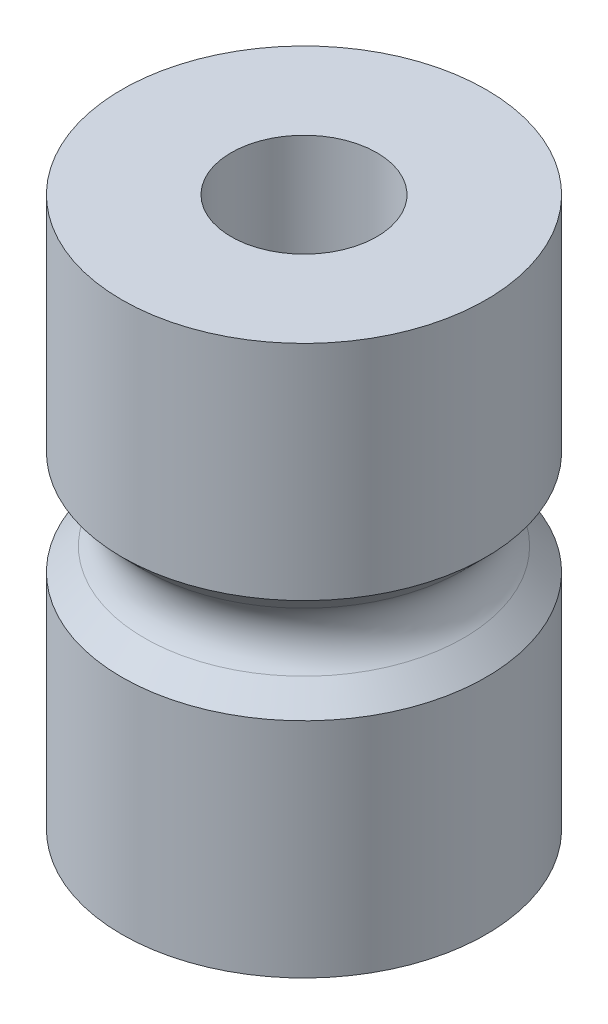
ISO-10303-21;
HEADER;
FILE_DESCRIPTION(('STEP AP214'),'2;1');
FILE_NAME('part.step','',(''),(''),'','','');
FILE_SCHEMA(('AUTOMOTIVE_DESIGN { 1 0 10303 214 1 1 1 1 }'));
ENDSEC;
DATA;
#1=APPLICATION_CONTEXT('core data for automotive mechanical design processes');
#2=APPLICATION_PROTOCOL_DEFINITION('international standard','automotive_design',2000,#1);
#3=PRODUCT_CONTEXT('',#1,'mechanical');
#4=PRODUCT('Part','Part','',(#3));
#5=PRODUCT_RELATED_PRODUCT_CATEGORY('part','',(#4));
#6=PRODUCT_DEFINITION_FORMATION('','',#4);
#7=PRODUCT_DEFINITION_CONTEXT('part definition',#1,'design');
#8=PRODUCT_DEFINITION('design','',#6,#7);
#9=PRODUCT_DEFINITION_SHAPE('','',#8);
#10=(LENGTH_UNIT() NAMED_UNIT(*) SI_UNIT(.MILLI.,.METRE.));
#11=(NAMED_UNIT(*) PLANE_ANGLE_UNIT() SI_UNIT($,.RADIAN.));
#12=(NAMED_UNIT(*) SI_UNIT($,.STERADIAN.) SOLID_ANGLE_UNIT());
#13=UNCERTAINTY_MEASURE_WITH_UNIT(LENGTH_MEASURE(1.E-05),#10,'distance_accuracy_value','');
#14=(GEOMETRIC_REPRESENTATION_CONTEXT(3) GLOBAL_UNCERTAINTY_ASSIGNED_CONTEXT((#13)) GLOBAL_UNIT_ASSIGNED_CONTEXT((#10,
#11,#12)) REPRESENTATION_CONTEXT('',''));
#15=CARTESIAN_POINT('',(0.,0.,0.));
#16=DIRECTION('',(0.,0.,1.));
#17=DIRECTION('',(1.,0.,0.));
#18=AXIS2_PLACEMENT_3D('',#15,#16,#17);
#19=CARTESIAN_POINT('',(0.,0.,0.));
#20=DIRECTION('',(0.,-1.,0.));
#21=DIRECTION('',(0.,0.,-1.));
#22=AXIS2_PLACEMENT_3D('',#19,#20,#21);
#23=CYLINDRICAL_SURFACE('',#22,4.445);
#24=CARTESIAN_POINT('',(0.,0.,0.));
#25=DIRECTION('',(0.,-1.,0.));
#26=DIRECTION('',(0.,0.,-1.));
#27=AXIS2_PLACEMENT_3D('',#24,#25,#26);
#28=CIRCLE('',#27,4.445);
#29=CARTESIAN_POINT('',(0.,0.,-4.445));
#30=VERTEX_POINT('',#29);
#31=EDGE_CURVE('E64',#30,#30,#28,.T.);
#32=ORIENTED_EDGE('',*,*,#31,.T.);
#33=EDGE_LOOP('',(#32));
#34=FACE_BOUND('',#33,.T.);
#35=CARTESIAN_POINT('',(0.,33.528,0.));
#36=DIRECTION('',(0.,-1.,0.));
#37=DIRECTION('',(0.,0.,-1.));
#38=AXIS2_PLACEMENT_3D('',#35,#36,#37);
#39=CIRCLE('',#38,4.445);
#40=CARTESIAN_POINT('',(0.,33.528,-4.445));
#41=VERTEX_POINT('',#40);
#42=EDGE_CURVE('E46',#41,#41,#39,.T.);
#43=ORIENTED_EDGE('',*,*,#42,.F.);
#44=EDGE_LOOP('',(#43));
#45=FACE_BOUND('',#44,.T.);
#46=ADVANCED_FACE('F35',(#34,#45),#23,.F.);
#47=CARTESIAN_POINT('',(4.445,33.528,0.));
#48=DIRECTION('',(0.,1.,0.));
#49=DIRECTION('',(0.,0.,1.));
#50=AXIS2_PLACEMENT_3D('',#47,#48,#49);
#51=PLANE('',#50);
#52=ORIENTED_EDGE('',*,*,#42,.T.);
#53=EDGE_LOOP('',(#52));
#54=FACE_BOUND('',#53,.T.);
#55=CARTESIAN_POINT('',(0.,33.528,0.));
#56=DIRECTION('',(0.,-1.,0.));
#57=DIRECTION('',(0.,0.,-1.));
#58=AXIS2_PLACEMENT_3D('',#55,#56,#57);
#59=CIRCLE('',#58,11.1125);
#60=CARTESIAN_POINT('',(0.,33.528,-11.1125));
#61=VERTEX_POINT('',#60);
#62=EDGE_CURVE('E50',#61,#61,#59,.T.);
#63=ORIENTED_EDGE('',*,*,#62,.F.);
#64=EDGE_LOOP('',(#63));
#65=FACE_BOUND('',#64,.T.);
#66=ADVANCED_FACE('F84',(#54,#65),#51,.T.);
#67=CARTESIAN_POINT('',(0.,0.,0.));
#68=DIRECTION('',(0.,-1.,0.));
#69=DIRECTION('',(0.,0.,-1.));
#70=AXIS2_PLACEMENT_3D('',#67,#68,#69);
#71=CYLINDRICAL_SURFACE('',#70,11.1125);
#72=ORIENTED_EDGE('',*,*,#62,.T.);
#73=EDGE_LOOP('',(#72));
#74=FACE_BOUND('',#73,.T.);
#75=CARTESIAN_POINT('',(0.,19.939,0.));
#76=DIRECTION('',(0.,-1.,0.));
#77=DIRECTION('',(0.,0.,-1.));
#78=AXIS2_PLACEMENT_3D('',#75,#76,#77);
#79=CIRCLE('',#78,11.1125);
#80=CARTESIAN_POINT('',(0.,19.939,-11.1125));
#81=VERTEX_POINT('',#80);
#82=EDGE_CURVE('E55',#81,#81,#79,.T.);
#83=ORIENTED_EDGE('',*,*,#82,.F.);
#84=EDGE_LOOP('',(#83));
#85=FACE_BOUND('',#84,.T.);
#86=ADVANCED_FACE('F88',(#74,#85),#71,.T.);
#87=CARTESIAN_POINT('',(0.,16.764,0.));
#88=DIRECTION('',(0.,1.,0.));
#89=DIRECTION('',(0.,0.,1.));
#90=AXIS2_PLACEMENT_3D('',#87,#88,#89);
#91=CONICAL_SURFACE('',#90,7.93750000000001,0.785398163397448);
#92=CARTESIAN_POINT('',(0.,18.5600512242138,0.));
#93=DIRECTION('',(0.,1.,0.));
#94=DIRECTION('',(0.,0.,1.));
#95=AXIS2_PLACEMENT_3D('',#92,#93,#94);
#96=CIRCLE('',#95,9.73355122421384);
#97=CARTESIAN_POINT('',(0.,18.5600512242138,9.73355122421384));
#98=VERTEX_POINT('',#97);
#99=EDGE_CURVE('E10',#98,#98,#96,.T.);
#100=ORIENTED_EDGE('',*,*,#99,.T.);
#101=EDGE_LOOP('',(#100));
#102=FACE_BOUND('',#101,.T.);
#103=ORIENTED_EDGE('',*,*,#82,.T.);
#104=EDGE_LOOP('',(#103));
#105=FACE_BOUND('',#104,.T.);
#106=ADVANCED_FACE('F94',(#102,#105),#91,.T.);
#107=CARTESIAN_POINT('',(0.,13.589,0.));
#108=DIRECTION('',(0.,-1.,0.));
#109=DIRECTION('',(0.,0.,-1.));
#110=AXIS2_PLACEMENT_3D('',#107,#108,#109);
#111=CONICAL_SURFACE('',#110,11.1125,0.785398163397447);
#112=CARTESIAN_POINT('',(0.,14.9679487757862,0.));
#113=DIRECTION('',(0.,-1.,0.));
#114=DIRECTION('',(0.,0.,-1.));
#115=AXIS2_PLACEMENT_3D('',#112,#113,#114);
#116=CIRCLE('',#115,9.73355122421384);
#117=CARTESIAN_POINT('',(0.,14.9679487757862,-9.73355122421384));
#118=VERTEX_POINT('',#117);
#119=EDGE_CURVE('E42',#118,#118,#116,.T.);
#120=ORIENTED_EDGE('',*,*,#119,.T.);
#121=EDGE_LOOP('',(#120));
#122=FACE_BOUND('',#121,.T.);
#123=CARTESIAN_POINT('',(0.,13.589,0.));
#124=DIRECTION('',(0.,-1.,0.));
#125=DIRECTION('',(0.,0.,-1.));
#126=AXIS2_PLACEMENT_3D('',#123,#124,#125);
#127=CIRCLE('',#126,11.1125);
#128=CARTESIAN_POINT('',(0.,13.589,-11.1125));
#129=VERTEX_POINT('',#128);
#130=EDGE_CURVE('E58',#129,#129,#127,.T.);
#131=ORIENTED_EDGE('',*,*,#130,.F.);
#132=EDGE_LOOP('',(#131));
#133=FACE_BOUND('',#132,.T.);
#134=ADVANCED_FACE('F80',(#122,#133),#111,.T.);
#135=CARTESIAN_POINT('',(0.,0.,0.));
#136=DIRECTION('',(0.,-1.,0.));
#137=DIRECTION('',(0.,0.,-1.));
#138=AXIS2_PLACEMENT_3D('',#135,#136,#137);
#139=CYLINDRICAL_SURFACE('',#138,11.1125);
#140=ORIENTED_EDGE('',*,*,#130,.T.);
#141=EDGE_LOOP('',(#140));
#142=FACE_BOUND('',#141,.T.);
#143=CARTESIAN_POINT('',(0.,0.,0.));
#144=DIRECTION('',(0.,-1.,0.));
#145=DIRECTION('',(0.,0.,-1.));
#146=AXIS2_PLACEMENT_3D('',#143,#144,#145);
#147=CIRCLE('',#146,11.1125);
#148=CARTESIAN_POINT('',(0.,0.,-11.1125));
#149=VERTEX_POINT('',#148);
#150=EDGE_CURVE('E61',#149,#149,#147,.T.);
#151=ORIENTED_EDGE('',*,*,#150,.F.);
#152=EDGE_LOOP('',(#151));
#153=FACE_BOUND('',#152,.T.);
#154=ADVANCED_FACE('F72',(#142,#153),#139,.T.);
#155=CARTESIAN_POINT('',(4.445,0.,0.));
#156=DIRECTION('',(0.,-1.,0.));
#157=DIRECTION('',(0.,0.,-1.));
#158=AXIS2_PLACEMENT_3D('',#155,#156,#157);
#159=PLANE('',#158);
#160=ORIENTED_EDGE('',*,*,#150,.T.);
#161=EDGE_LOOP('',(#160));
#162=FACE_BOUND('',#161,.T.);
#163=ORIENTED_EDGE('',*,*,#31,.F.);
#164=EDGE_LOOP('',(#163));
#165=FACE_BOUND('',#164,.T.);
#166=ADVANCED_FACE('F70',(#162,#165),#159,.T.);
#167=CARTESIAN_POINT('',(0.,16.764,0.));
#168=DIRECTION('',(0.,-1.,0.));
#169=DIRECTION('',(0.,0.,-1.));
#170=AXIS2_PLACEMENT_3D('',#167,#168,#169);
#171=TOROIDAL_SURFACE('',#170,11.5296024484277,2.54);
#172=ORIENTED_EDGE('',*,*,#99,.F.);
#173=EDGE_LOOP('',(#172));
#174=FACE_BOUND('',#173,.T.);
#175=ORIENTED_EDGE('',*,*,#119,.F.);
#176=EDGE_LOOP('',(#175));
#177=FACE_BOUND('',#176,.T.);
#178=ADVANCED_FACE('F37',(#174,#177),#171,.F.);
#179=CLOSED_SHELL('',(#46,#66,#86,#106,#134,#154,#166,#178));
#180=MANIFOLD_SOLID_BREP('B2',#179);
#181=ADVANCED_BREP_SHAPE_REPRESENTATION('',(#18,#180),#14);
#182=SHAPE_DEFINITION_REPRESENTATION(#9,#181);
ENDSEC;
END-ISO-10303-21;
